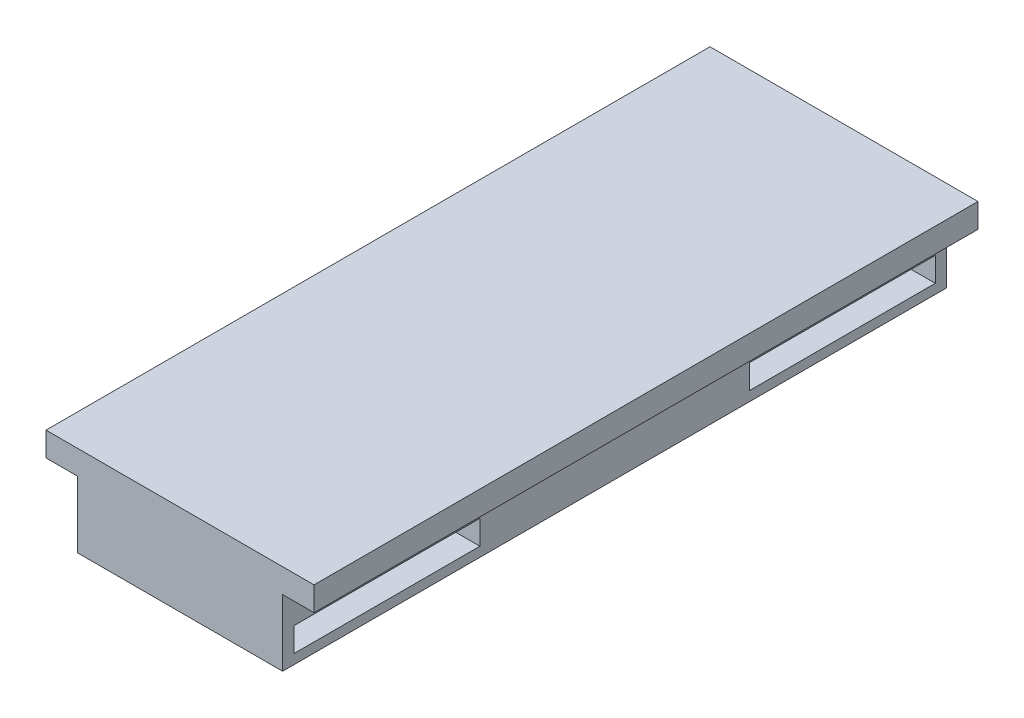
ISO-10303-21;
HEADER;
FILE_DESCRIPTION(('STEP AP214'),'2;1');
FILE_NAME('part.step','',(''),(''),'','','');
FILE_SCHEMA(('AUTOMOTIVE_DESIGN { 1 0 10303 214 1 1 1 1 }'));
ENDSEC;
DATA;
#1=APPLICATION_CONTEXT('core data for automotive mechanical design processes');
#2=APPLICATION_PROTOCOL_DEFINITION('international standard','automotive_design',2000,#1);
#3=PRODUCT_CONTEXT('',#1,'mechanical');
#4=PRODUCT('Part','Part','',(#3));
#5=PRODUCT_RELATED_PRODUCT_CATEGORY('part','',(#4));
#6=PRODUCT_DEFINITION_FORMATION('','',#4);
#7=PRODUCT_DEFINITION_CONTEXT('part definition',#1,'design');
#8=PRODUCT_DEFINITION('design','',#6,#7);
#9=PRODUCT_DEFINITION_SHAPE('','',#8);
#10=(LENGTH_UNIT() NAMED_UNIT(*) SI_UNIT(.MILLI.,.METRE.));
#11=(NAMED_UNIT(*) PLANE_ANGLE_UNIT() SI_UNIT($,.RADIAN.));
#12=(NAMED_UNIT(*) SI_UNIT($,.STERADIAN.) SOLID_ANGLE_UNIT());
#13=UNCERTAINTY_MEASURE_WITH_UNIT(LENGTH_MEASURE(1.E-05),#10,'distance_accuracy_value','');
#14=(GEOMETRIC_REPRESENTATION_CONTEXT(3) GLOBAL_UNCERTAINTY_ASSIGNED_CONTEXT((#13)) GLOBAL_UNIT_ASSIGNED_CONTEXT((#10,
#11,#12)) REPRESENTATION_CONTEXT('',''));
#15=CARTESIAN_POINT('',(0.,0.,0.));
#16=DIRECTION('',(0.,0.,1.));
#17=DIRECTION('',(1.,0.,0.));
#18=AXIS2_PLACEMENT_3D('',#15,#16,#17);
#19=CARTESIAN_POINT('',(11.1,0.519205922994457,-8.64));
#20=DIRECTION('',(0.,-1.,0.));
#21=DIRECTION('',(0.,0.,-1.));
#22=AXIS2_PLACEMENT_3D('',#19,#20,#21);
#23=CYLINDRICAL_SURFACE('',#22,7.7);
#24=DIRECTION('',(0.,-1.,0.));
#25=VECTOR('',#24,1.);
#26=CARTESIAN_POINT('',(11.1,0.519205922994459,-0.940000000000003));
#27=LINE('',#26,#25);
#28=CARTESIAN_POINT('',(11.1,0.519205922994459,-0.940000000000003));
#29=VERTEX_POINT('',#28);
#30=CARTESIAN_POINT('',(11.1,-1.48079407700554,-0.940000000000003));
#31=VERTEX_POINT('',#30);
#32=EDGE_CURVE('E150',#29,#31,#27,.T.);
#33=ORIENTED_EDGE('',*,*,#32,.T.);
#34=CARTESIAN_POINT('',(11.1,-1.48079407700554,-8.64));
#35=DIRECTION('',(0.,-1.,0.));
#36=DIRECTION('',(0.,0.,-1.));
#37=AXIS2_PLACEMENT_3D('',#34,#35,#36);
#38=CIRCLE('',#37,7.7);
#39=CARTESIAN_POINT('',(11.1,-1.48079407700554,-16.34));
#40=VERTEX_POINT('',#39);
#41=EDGE_CURVE('E44',#40,#31,#38,.F.);
#42=ORIENTED_EDGE('',*,*,#41,.F.);
#43=DIRECTION('',(0.,1.,0.));
#44=VECTOR('',#43,1.);
#45=CARTESIAN_POINT('',(11.1,0.519205922994459,-16.34));
#46=LINE('',#45,#44);
#47=CARTESIAN_POINT('',(11.1,0.519205922994457,-16.34));
#48=VERTEX_POINT('',#47);
#49=EDGE_CURVE('E157',#40,#48,#46,.T.);
#50=ORIENTED_EDGE('',*,*,#49,.T.);
#51=CARTESIAN_POINT('',(11.1,0.519205922994457,-8.64));
#52=DIRECTION('',(0.,-1.,0.));
#53=DIRECTION('',(0.,0.,-1.));
#54=AXIS2_PLACEMENT_3D('',#51,#52,#53);
#55=CIRCLE('',#54,7.7);
#56=EDGE_CURVE('E163',#29,#48,#55,.T.);
#57=ORIENTED_EDGE('',*,*,#56,.F.);
#58=EDGE_LOOP('',(#33,#42,#50,#57));
#59=FACE_BOUND('',#58,.T.);
#60=ADVANCED_FACE('F36',(#59),#23,.F.);
#61=CARTESIAN_POINT('',(11.1,0.519205922994457,-46.36));
#62=DIRECTION('',(0.,-1.,0.));
#63=DIRECTION('',(0.,0.,-1.));
#64=AXIS2_PLACEMENT_3D('',#61,#62,#63);
#65=CYLINDRICAL_SURFACE('',#64,7.7);
#66=DIRECTION('',(0.,-1.,0.));
#67=VECTOR('',#66,1.);
#68=CARTESIAN_POINT('',(11.1,0.519205922994459,-38.66));
#69=LINE('',#68,#67);
#70=CARTESIAN_POINT('',(11.1,0.519205922994459,-38.66));
#71=VERTEX_POINT('',#70);
#72=CARTESIAN_POINT('',(11.1,-1.48079407700554,-38.66));
#73=VERTEX_POINT('',#72);
#74=EDGE_CURVE('E262',#71,#73,#69,.T.);
#75=ORIENTED_EDGE('',*,*,#74,.T.);
#76=CARTESIAN_POINT('',(11.1,-1.48079407700554,-46.36));
#77=DIRECTION('',(0.,-1.,0.));
#78=DIRECTION('',(0.,0.,-1.));
#79=AXIS2_PLACEMENT_3D('',#76,#77,#78);
#80=CIRCLE('',#79,7.7);
#81=CARTESIAN_POINT('',(11.1,-1.48079407700554,-54.06));
#82=VERTEX_POINT('',#81);
#83=EDGE_CURVE('E11',#82,#73,#80,.F.);
#84=ORIENTED_EDGE('',*,*,#83,.F.);
#85=DIRECTION('',(0.,1.,0.));
#86=VECTOR('',#85,1.);
#87=CARTESIAN_POINT('',(11.1,0.519205922994459,-54.06));
#88=LINE('',#87,#86);
#89=CARTESIAN_POINT('',(11.1,0.519205922994457,-54.06));
#90=VERTEX_POINT('',#89);
#91=EDGE_CURVE('E253',#82,#90,#88,.T.);
#92=ORIENTED_EDGE('',*,*,#91,.T.);
#93=CARTESIAN_POINT('',(11.1,0.519205922994457,-46.36));
#94=DIRECTION('',(0.,-1.,0.));
#95=DIRECTION('',(0.,0.,-1.));
#96=AXIS2_PLACEMENT_3D('',#93,#94,#95);
#97=CIRCLE('',#96,7.7);
#98=EDGE_CURVE('E233',#71,#90,#97,.T.);
#99=ORIENTED_EDGE('',*,*,#98,.F.);
#100=EDGE_LOOP('',(#75,#84,#92,#99));
#101=FACE_BOUND('',#100,.T.);
#102=ADVANCED_FACE('F303',(#101),#65,.F.);
#103=CARTESIAN_POINT('',(2.6,-2.28079407700554,-55.));
#104=DIRECTION('',(-1.,0.,0.));
#105=DIRECTION('',(0.,-1.,0.));
#106=AXIS2_PLACEMENT_3D('',#103,#104,#105);
#107=PLANE('',#106);
#108=DIRECTION('',(0.,-1.,0.));
#109=VECTOR('',#108,1.);
#110=CARTESIAN_POINT('',(2.6,-2.28079407700554,0.));
#111=LINE('',#110,#109);
#112=CARTESIAN_POINT('',(2.6,3.21920592299446,0.));
#113=VERTEX_POINT('',#112);
#114=CARTESIAN_POINT('',(2.6,-2.28079407700554,0.));
#115=VERTEX_POINT('',#114);
#116=EDGE_CURVE('E208',#113,#115,#111,.T.);
#117=ORIENTED_EDGE('',*,*,#116,.F.);
#118=DIRECTION('',(0.,0.,1.));
#119=VECTOR('',#118,1.);
#120=CARTESIAN_POINT('',(2.6,3.21920592299446,-55.));
#121=LINE('',#120,#119);
#122=CARTESIAN_POINT('',(2.6,3.21920592299446,-55.));
#123=VERTEX_POINT('',#122);
#124=EDGE_CURVE('E168',#123,#113,#121,.T.);
#125=ORIENTED_EDGE('',*,*,#124,.F.);
#126=DIRECTION('',(0.,-1.,0.));
#127=VECTOR('',#126,1.);
#128=CARTESIAN_POINT('',(2.6,-2.28079407700554,-55.));
#129=LINE('',#128,#127);
#130=CARTESIAN_POINT('',(2.6,-2.28079407700554,-55.));
#131=VERTEX_POINT('',#130);
#132=EDGE_CURVE('E189',#123,#131,#129,.T.);
#133=ORIENTED_EDGE('',*,*,#132,.T.);
#134=DIRECTION('',(0.,0.,1.));
#135=VECTOR('',#134,1.);
#136=CARTESIAN_POINT('',(2.6,-2.28079407700554,-55.));
#137=LINE('',#136,#135);
#138=EDGE_CURVE('E172',#131,#115,#137,.T.);
#139=ORIENTED_EDGE('',*,*,#138,.T.);
#140=EDGE_LOOP('',(#117,#125,#133,#139));
#141=FACE_BOUND('',#140,.T.);
#142=ADVANCED_FACE('F38',(#141),#107,.T.);
#143=CARTESIAN_POINT('',(2.6,3.21920592299446,-55.));
#144=DIRECTION('',(0.,-1.,0.));
#145=DIRECTION('',(1.,0.,0.));
#146=AXIS2_PLACEMENT_3D('',#143,#144,#145);
#147=PLANE('',#146);
#148=DIRECTION('',(1.,0.,0.));
#149=VECTOR('',#148,1.);
#150=CARTESIAN_POINT('',(2.6,3.21920592299446,0.));
#151=LINE('',#150,#149);
#152=CARTESIAN_POINT('',(0.,3.21920592299446,0.));
#153=VERTEX_POINT('',#152);
#154=EDGE_CURVE('E186',#153,#113,#151,.T.);
#155=ORIENTED_EDGE('',*,*,#154,.F.);
#156=DIRECTION('',(0.,0.,1.));
#157=VECTOR('',#156,1.);
#158=CARTESIAN_POINT('',(0.,3.21920592299446,-55.));
#159=LINE('',#158,#157);
#160=CARTESIAN_POINT('',(0.,3.21920592299446,-55.));
#161=VERTEX_POINT('',#160);
#162=EDGE_CURVE('E169',#161,#153,#159,.T.);
#163=ORIENTED_EDGE('',*,*,#162,.F.);
#164=DIRECTION('',(1.,0.,0.));
#165=VECTOR('',#164,1.);
#166=CARTESIAN_POINT('',(2.6,3.21920592299446,-55.));
#167=LINE('',#166,#165);
#168=EDGE_CURVE('E175',#161,#123,#167,.T.);
#169=ORIENTED_EDGE('',*,*,#168,.T.);
#170=ORIENTED_EDGE('',*,*,#124,.T.);
#171=EDGE_LOOP('',(#155,#163,#169,#170));
#172=FACE_BOUND('',#171,.T.);
#173=ADVANCED_FACE('F328',(#172),#147,.T.);
#174=CARTESIAN_POINT('',(0.,3.21920592299446,-55.));
#175=DIRECTION('',(-1.,0.,0.));
#176=DIRECTION('',(0.,0.,1.));
#177=AXIS2_PLACEMENT_3D('',#174,#175,#176);
#178=PLANE('',#177);
#179=DIRECTION('',(0.,-1.,0.));
#180=VECTOR('',#179,1.);
#181=CARTESIAN_POINT('',(0.,3.21920592299446,0.));
#182=LINE('',#181,#180);
#183=CARTESIAN_POINT('',(0.,5.21920592299446,0.));
#184=VERTEX_POINT('',#183);
#185=EDGE_CURVE('E190',#184,#153,#182,.T.);
#186=ORIENTED_EDGE('',*,*,#185,.F.);
#187=DIRECTION('',(0.,0.,1.));
#188=VECTOR('',#187,1.);
#189=CARTESIAN_POINT('',(0.,5.21920592299446,-55.));
#190=LINE('',#189,#188);
#191=CARTESIAN_POINT('',(0.,5.21920592299446,-55.));
#192=VERTEX_POINT('',#191);
#193=EDGE_CURVE('E183',#192,#184,#190,.T.);
#194=ORIENTED_EDGE('',*,*,#193,.F.);
#195=DIRECTION('',(0.,-1.,0.));
#196=VECTOR('',#195,1.);
#197=CARTESIAN_POINT('',(0.,3.21920592299446,-55.));
#198=LINE('',#197,#196);
#199=EDGE_CURVE('E213',#192,#161,#198,.T.);
#200=ORIENTED_EDGE('',*,*,#199,.T.);
#201=ORIENTED_EDGE('',*,*,#162,.T.);
#202=EDGE_LOOP('',(#186,#194,#200,#201));
#203=FACE_BOUND('',#202,.T.);
#204=ADVANCED_FACE('F331',(#203),#178,.T.);
#205=CARTESIAN_POINT('',(0.,5.21920592299446,-55.));
#206=DIRECTION('',(0.,1.,0.));
#207=DIRECTION('',(-1.,0.,0.));
#208=AXIS2_PLACEMENT_3D('',#205,#206,#207);
#209=PLANE('',#208);
#210=DIRECTION('',(-1.,0.,0.));
#211=VECTOR('',#210,1.);
#212=CARTESIAN_POINT('',(0.,5.21920592299446,0.));
#213=LINE('',#212,#211);
#214=CARTESIAN_POINT('',(22.2,5.21920592299446,0.));
#215=VERTEX_POINT('',#214);
#216=EDGE_CURVE('E193',#215,#184,#213,.T.);
#217=ORIENTED_EDGE('',*,*,#216,.F.);
#218=DIRECTION('',(0.,0.,1.));
#219=VECTOR('',#218,1.);
#220=CARTESIAN_POINT('',(22.2,5.21920592299446,-55.));
#221=LINE('',#220,#219);
#222=CARTESIAN_POINT('',(22.2,5.21920592299446,-55.));
#223=VERTEX_POINT('',#222);
#224=EDGE_CURVE('E181',#223,#215,#221,.T.);
#225=ORIENTED_EDGE('',*,*,#224,.F.);
#226=DIRECTION('',(-1.,0.,0.));
#227=VECTOR('',#226,1.);
#228=CARTESIAN_POINT('',(0.,5.21920592299446,-55.));
#229=LINE('',#228,#227);
#230=EDGE_CURVE('E216',#223,#192,#229,.T.);
#231=ORIENTED_EDGE('',*,*,#230,.T.);
#232=ORIENTED_EDGE('',*,*,#193,.T.);
#233=EDGE_LOOP('',(#217,#225,#231,#232));
#234=FACE_BOUND('',#233,.T.);
#235=ADVANCED_FACE('F335',(#234),#209,.T.);
#236=CARTESIAN_POINT('',(22.2,5.21920592299446,-55.));
#237=DIRECTION('',(1.,0.,0.));
#238=DIRECTION('',(0.,0.,-1.));
#239=AXIS2_PLACEMENT_3D('',#236,#237,#238);
#240=PLANE('',#239);
#241=DIRECTION('',(0.,1.,0.));
#242=VECTOR('',#241,1.);
#243=CARTESIAN_POINT('',(22.2,5.21920592299446,0.));
#244=LINE('',#243,#242);
#245=CARTESIAN_POINT('',(22.2,3.21920592299446,0.));
#246=VERTEX_POINT('',#245);
#247=EDGE_CURVE('E196',#246,#215,#244,.T.);
#248=ORIENTED_EDGE('',*,*,#247,.F.);
#249=DIRECTION('',(0.,0.,1.));
#250=VECTOR('',#249,1.);
#251=CARTESIAN_POINT('',(22.2,3.21920592299446,-55.));
#252=LINE('',#251,#250);
#253=CARTESIAN_POINT('',(22.2,3.21920592299446,-55.));
#254=VERTEX_POINT('',#253);
#255=EDGE_CURVE('E179',#254,#246,#252,.T.);
#256=ORIENTED_EDGE('',*,*,#255,.F.);
#257=DIRECTION('',(0.,1.,0.));
#258=VECTOR('',#257,1.);
#259=CARTESIAN_POINT('',(22.2,5.21920592299446,-55.));
#260=LINE('',#259,#258);
#261=EDGE_CURVE('E219',#254,#223,#260,.T.);
#262=ORIENTED_EDGE('',*,*,#261,.T.);
#263=ORIENTED_EDGE('',*,*,#224,.T.);
#264=EDGE_LOOP('',(#248,#256,#262,#263));
#265=FACE_BOUND('',#264,.T.);
#266=ADVANCED_FACE('F339',(#265),#240,.T.);
#267=CARTESIAN_POINT('',(22.2,3.21920592299446,-55.));
#268=DIRECTION('',(0.,-1.,0.));
#269=DIRECTION('',(1.,0.,0.));
#270=AXIS2_PLACEMENT_3D('',#267,#268,#269);
#271=PLANE('',#270);
#272=DIRECTION('',(1.,0.,0.));
#273=VECTOR('',#272,1.);
#274=CARTESIAN_POINT('',(22.2,3.21920592299446,0.));
#275=LINE('',#274,#273);
#276=CARTESIAN_POINT('',(19.6,3.21920592299446,0.));
#277=VERTEX_POINT('',#276);
#278=EDGE_CURVE('E199',#277,#246,#275,.T.);
#279=ORIENTED_EDGE('',*,*,#278,.F.);
#280=DIRECTION('',(0.,0.,1.));
#281=VECTOR('',#280,1.);
#282=CARTESIAN_POINT('',(19.6,3.21920592299446,-55.));
#283=LINE('',#282,#281);
#284=CARTESIAN_POINT('',(19.6,3.21920592299446,-55.));
#285=VERTEX_POINT('',#284);
#286=EDGE_CURVE('E177',#285,#277,#283,.T.);
#287=ORIENTED_EDGE('',*,*,#286,.F.);
#288=DIRECTION('',(1.,0.,0.));
#289=VECTOR('',#288,1.);
#290=CARTESIAN_POINT('',(22.2,3.21920592299446,-55.));
#291=LINE('',#290,#289);
#292=EDGE_CURVE('E222',#285,#254,#291,.T.);
#293=ORIENTED_EDGE('',*,*,#292,.T.);
#294=ORIENTED_EDGE('',*,*,#255,.T.);
#295=EDGE_LOOP('',(#279,#287,#293,#294));
#296=FACE_BOUND('',#295,.T.);
#297=ADVANCED_FACE('F343',(#296),#271,.T.);
#298=CARTESIAN_POINT('',(19.6,-2.28079407700554,-55.));
#299=DIRECTION('',(1.,0.,0.));
#300=DIRECTION('',(0.,0.,-1.));
#301=AXIS2_PLACEMENT_3D('',#298,#299,#300);
#302=PLANE('',#301);
#303=DIRECTION('',(0.,-1.,0.));
#304=VECTOR('',#303,1.);
#305=CARTESIAN_POINT('',(19.6,0.519205922994459,-0.940000000000003));
#306=LINE('',#305,#304);
#307=CARTESIAN_POINT('',(19.6,0.519205922994459,-0.940000000000003));
#308=VERTEX_POINT('',#307);
#309=CARTESIAN_POINT('',(19.6,-1.48079407700554,-0.940000000000003));
#310=VERTEX_POINT('',#309);
#311=EDGE_CURVE('E51',#308,#310,#306,.T.);
#312=ORIENTED_EDGE('',*,*,#311,.F.);
#313=DIRECTION('',(0.,0.,1.));
#314=VECTOR('',#313,1.);
#315=CARTESIAN_POINT('',(19.6,0.519205922994459,-0.940000000000003));
#316=LINE('',#315,#314);
#317=CARTESIAN_POINT('',(19.6,0.519205922994459,-16.34));
#318=VERTEX_POINT('',#317);
#319=EDGE_CURVE('E164',#318,#308,#316,.T.);
#320=ORIENTED_EDGE('',*,*,#319,.F.);
#321=DIRECTION('',(0.,1.,0.));
#322=VECTOR('',#321,1.);
#323=CARTESIAN_POINT('',(19.6,0.519205922994459,-16.34));
#324=LINE('',#323,#322);
#325=CARTESIAN_POINT('',(19.6,-1.48079407700554,-16.34));
#326=VERTEX_POINT('',#325);
#327=EDGE_CURVE('E280',#326,#318,#324,.T.);
#328=ORIENTED_EDGE('',*,*,#327,.F.);
#329=DIRECTION('',(0.,0.,-1.));
#330=VECTOR('',#329,1.);
#331=CARTESIAN_POINT('',(19.6,-1.48079407700554,-0.940000000000003));
#332=LINE('',#331,#330);
#333=EDGE_CURVE('E283',#310,#326,#332,.T.);
#334=ORIENTED_EDGE('',*,*,#333,.F.);
#335=EDGE_LOOP('',(#312,#320,#328,#334));
#336=FACE_BOUND('',#335,.T.);
#337=DIRECTION('',(0.,-1.,0.));
#338=VECTOR('',#337,1.);
#339=CARTESIAN_POINT('',(19.6,0.519205922994459,-38.66));
#340=LINE('',#339,#338);
#341=CARTESIAN_POINT('',(19.6,0.519205922994459,-38.66));
#342=VERTEX_POINT('',#341);
#343=CARTESIAN_POINT('',(19.6,-1.48079407700554,-38.66));
#344=VERTEX_POINT('',#343);
#345=EDGE_CURVE('E59',#342,#344,#340,.T.);
#346=ORIENTED_EDGE('',*,*,#345,.F.);
#347=DIRECTION('',(0.,0.,1.));
#348=VECTOR('',#347,1.);
#349=CARTESIAN_POINT('',(19.6,0.519205922994459,-38.66));
#350=LINE('',#349,#348);
#351=CARTESIAN_POINT('',(19.6,0.519205922994459,-54.06));
#352=VERTEX_POINT('',#351);
#353=EDGE_CURVE('E259',#352,#342,#350,.T.);
#354=ORIENTED_EDGE('',*,*,#353,.F.);
#355=DIRECTION('',(0.,1.,0.));
#356=VECTOR('',#355,1.);
#357=CARTESIAN_POINT('',(19.6,0.519205922994459,-54.06));
#358=LINE('',#357,#356);
#359=CARTESIAN_POINT('',(19.6,-1.48079407700554,-54.06));
#360=VERTEX_POINT('',#359);
#361=EDGE_CURVE('E263',#360,#352,#358,.T.);
#362=ORIENTED_EDGE('',*,*,#361,.F.);
#363=DIRECTION('',(0.,0.,-1.));
#364=VECTOR('',#363,1.);
#365=CARTESIAN_POINT('',(19.6,-1.48079407700554,-38.66));
#366=LINE('',#365,#364);
#367=EDGE_CURVE('E266',#344,#360,#366,.T.);
#368=ORIENTED_EDGE('',*,*,#367,.F.);
#369=EDGE_LOOP('',(#346,#354,#362,#368));
#370=FACE_BOUND('',#369,.T.);
#371=DIRECTION('',(0.,1.,0.));
#372=VECTOR('',#371,1.);
#373=CARTESIAN_POINT('',(19.6,-2.28079407700554,0.));
#374=LINE('',#373,#372);
#375=CARTESIAN_POINT('',(19.6,-2.28079407700554,0.));
#376=VERTEX_POINT('',#375);
#377=EDGE_CURVE('E202',#376,#277,#374,.T.);
#378=ORIENTED_EDGE('',*,*,#377,.F.);
#379=DIRECTION('',(0.,0.,1.));
#380=VECTOR('',#379,1.);
#381=CARTESIAN_POINT('',(19.6,-2.28079407700554,-55.));
#382=LINE('',#381,#380);
#383=CARTESIAN_POINT('',(19.6,-2.28079407700554,-55.));
#384=VERTEX_POINT('',#383);
#385=EDGE_CURVE('E174',#384,#376,#382,.T.);
#386=ORIENTED_EDGE('',*,*,#385,.F.);
#387=DIRECTION('',(0.,1.,0.));
#388=VECTOR('',#387,1.);
#389=CARTESIAN_POINT('',(19.6,-2.28079407700554,-55.));
#390=LINE('',#389,#388);
#391=EDGE_CURVE('E225',#384,#285,#390,.T.);
#392=ORIENTED_EDGE('',*,*,#391,.T.);
#393=ORIENTED_EDGE('',*,*,#286,.T.);
#394=EDGE_LOOP('',(#378,#386,#392,#393));
#395=FACE_BOUND('',#394,.T.);
#396=ADVANCED_FACE('F292',(#336,#370,#395),#302,.T.);
#397=CARTESIAN_POINT('',(2.6,-2.28079407700554,-55.));
#398=DIRECTION('',(0.,-1.,0.));
#399=DIRECTION('',(1.,0.,0.));
#400=AXIS2_PLACEMENT_3D('',#397,#398,#399);
#401=PLANE('',#400);
#402=DIRECTION('',(1.,0.,0.));
#403=VECTOR('',#402,1.);
#404=CARTESIAN_POINT('',(2.6,-2.28079407700554,0.));
#405=LINE('',#404,#403);
#406=EDGE_CURVE('E205',#115,#376,#405,.T.);
#407=ORIENTED_EDGE('',*,*,#406,.F.);
#408=ORIENTED_EDGE('',*,*,#138,.F.);
#409=DIRECTION('',(1.,0.,0.));
#410=VECTOR('',#409,1.);
#411=CARTESIAN_POINT('',(2.6,-2.28079407700554,-55.));
#412=LINE('',#411,#410);
#413=EDGE_CURVE('E228',#131,#384,#412,.T.);
#414=ORIENTED_EDGE('',*,*,#413,.T.);
#415=ORIENTED_EDGE('',*,*,#385,.T.);
#416=EDGE_LOOP('',(#407,#408,#414,#415));
#417=FACE_BOUND('',#416,.T.);
#418=CARTESIAN_POINT('',(11.1,-2.28079407700554,-8.64));
#419=DIRECTION('',(0.,-1.,0.));
#420=DIRECTION('',(0.,0.,-1.));
#421=AXIS2_PLACEMENT_3D('',#418,#419,#420);
#422=CIRCLE('',#421,5.5);
#423=CARTESIAN_POINT('',(11.1,-2.28079407700554,-14.14));
#424=VERTEX_POINT('',#423);
#425=EDGE_CURVE('E238',#424,#424,#422,.T.);
#426=ORIENTED_EDGE('',*,*,#425,.F.);
#427=EDGE_LOOP('',(#426));
#428=FACE_BOUND('',#427,.T.);
#429=CARTESIAN_POINT('',(11.1,-2.28079407700554,-46.36));
#430=DIRECTION('',(0.,-1.,0.));
#431=DIRECTION('',(0.,0.,-1.));
#432=AXIS2_PLACEMENT_3D('',#429,#430,#431);
#433=CIRCLE('',#432,5.5);
#434=CARTESIAN_POINT('',(11.1,-2.28079407700554,-51.86));
#435=VERTEX_POINT('',#434);
#436=EDGE_CURVE('E244',#435,#435,#433,.T.);
#437=ORIENTED_EDGE('',*,*,#436,.F.);
#438=EDGE_LOOP('',(#437));
#439=FACE_BOUND('',#438,.T.);
#440=ADVANCED_FACE('F323',(#417,#428,#439),#401,.T.);
#441=CARTESIAN_POINT('',(0.,0.,-55.));
#442=DIRECTION('',(0.,0.,1.));
#443=DIRECTION('',(1.,0.,0.));
#444=AXIS2_PLACEMENT_3D('',#441,#442,#443);
#445=PLANE('',#444);
#446=ORIENTED_EDGE('',*,*,#132,.F.);
#447=ORIENTED_EDGE('',*,*,#168,.F.);
#448=ORIENTED_EDGE('',*,*,#199,.F.);
#449=ORIENTED_EDGE('',*,*,#230,.F.);
#450=ORIENTED_EDGE('',*,*,#261,.F.);
#451=ORIENTED_EDGE('',*,*,#292,.F.);
#452=ORIENTED_EDGE('',*,*,#391,.F.);
#453=ORIENTED_EDGE('',*,*,#413,.F.);
#454=EDGE_LOOP('',(#446,#447,#448,#449,#450,#451,#452,#453));
#455=FACE_BOUND('',#454,.T.);
#456=ADVANCED_FACE('F319',(#455),#445,.F.);
#457=CARTESIAN_POINT('',(0.,0.,0.));
#458=DIRECTION('',(0.,0.,1.));
#459=DIRECTION('',(1.,0.,0.));
#460=AXIS2_PLACEMENT_3D('',#457,#458,#459);
#461=PLANE('',#460);
#462=ORIENTED_EDGE('',*,*,#116,.T.);
#463=ORIENTED_EDGE('',*,*,#406,.T.);
#464=ORIENTED_EDGE('',*,*,#377,.T.);
#465=ORIENTED_EDGE('',*,*,#278,.T.);
#466=ORIENTED_EDGE('',*,*,#247,.T.);
#467=ORIENTED_EDGE('',*,*,#216,.T.);
#468=ORIENTED_EDGE('',*,*,#185,.T.);
#469=ORIENTED_EDGE('',*,*,#154,.T.);
#470=EDGE_LOOP('',(#462,#463,#464,#465,#466,#467,#468,#469));
#471=FACE_BOUND('',#470,.T.);
#472=ADVANCED_FACE('F322',(#471),#461,.T.);
#473=CARTESIAN_POINT('',(11.1,-1.48079407700554,-8.64));
#474=DIRECTION('',(0.,-1.,0.));
#475=DIRECTION('',(0.,0.,-1.));
#476=AXIS2_PLACEMENT_3D('',#473,#474,#475);
#477=PLANE('',#476);
#478=CARTESIAN_POINT('',(11.1,-1.48079407700554,-8.64));
#479=DIRECTION('',(0.,-1.,0.));
#480=DIRECTION('',(0.,0.,-1.));
#481=AXIS2_PLACEMENT_3D('',#478,#479,#480);
#482=CIRCLE('',#481,5.5);
#483=CARTESIAN_POINT('',(11.1,-1.48079407700554,-14.14));
#484=VERTEX_POINT('',#483);
#485=EDGE_CURVE('E236',#484,#484,#482,.T.);
#486=ORIENTED_EDGE('',*,*,#485,.T.);
#487=EDGE_LOOP('',(#486));
#488=FACE_BOUND('',#487,.T.);
#489=DIRECTION('',(1.,0.,0.));
#490=VECTOR('',#489,1.);
#491=CARTESIAN_POINT('',(11.1,-1.48079407700554,-16.34));
#492=LINE('',#491,#490);
#493=EDGE_CURVE('E156',#40,#326,#492,.T.);
#494=ORIENTED_EDGE('',*,*,#493,.F.);
#495=ORIENTED_EDGE('',*,*,#41,.T.);
#496=DIRECTION('',(1.,0.,0.));
#497=VECTOR('',#496,1.);
#498=CARTESIAN_POINT('',(11.1,-1.48079407700554,-0.940000000000003));
#499=LINE('',#498,#497);
#500=EDGE_CURVE('E147',#31,#310,#499,.T.);
#501=ORIENTED_EDGE('',*,*,#500,.T.);
#502=ORIENTED_EDGE('',*,*,#333,.T.);
#503=EDGE_LOOP('',(#494,#495,#501,#502));
#504=FACE_BOUND('',#503,.T.);
#505=ADVANCED_FACE('F166',(#488,#504),#477,.F.);
#506=CARTESIAN_POINT('',(11.1,-1.48079407700554,-8.64));
#507=DIRECTION('',(0.,-1.,0.));
#508=DIRECTION('',(0.,0.,-1.));
#509=AXIS2_PLACEMENT_3D('',#506,#507,#508);
#510=CYLINDRICAL_SURFACE('',#509,5.5);
#511=ORIENTED_EDGE('',*,*,#485,.F.);
#512=EDGE_LOOP('',(#511));
#513=FACE_BOUND('',#512,.T.);
#514=ORIENTED_EDGE('',*,*,#425,.T.);
#515=EDGE_LOOP('',(#514));
#516=FACE_BOUND('',#515,.T.);
#517=ADVANCED_FACE('F372',(#513,#516),#510,.F.);
#518=CARTESIAN_POINT('',(11.1,0.519205922994457,-8.64));
#519=DIRECTION('',(0.,-1.,0.));
#520=DIRECTION('',(0.,0.,-1.));
#521=AXIS2_PLACEMENT_3D('',#518,#519,#520);
#522=PLANE('',#521);
#523=DIRECTION('',(1.,0.,0.));
#524=VECTOR('',#523,1.);
#525=CARTESIAN_POINT('',(11.1,0.519205922994459,-0.940000000000003));
#526=LINE('',#525,#524);
#527=EDGE_CURVE('E247',#29,#308,#526,.T.);
#528=ORIENTED_EDGE('',*,*,#527,.F.);
#529=ORIENTED_EDGE('',*,*,#56,.T.);
#530=DIRECTION('',(1.,0.,0.));
#531=VECTOR('',#530,1.);
#532=CARTESIAN_POINT('',(11.1,0.519205922994459,-16.34));
#533=LINE('',#532,#531);
#534=EDGE_CURVE('E275',#48,#318,#533,.T.);
#535=ORIENTED_EDGE('',*,*,#534,.T.);
#536=ORIENTED_EDGE('',*,*,#319,.T.);
#537=EDGE_LOOP('',(#528,#529,#535,#536));
#538=FACE_BOUND('',#537,.T.);
#539=ADVANCED_FACE('F288',(#538),#522,.T.);
#540=CARTESIAN_POINT('',(11.1,-1.48079407700554,-46.36));
#541=DIRECTION('',(0.,-1.,0.));
#542=DIRECTION('',(0.,0.,-1.));
#543=AXIS2_PLACEMENT_3D('',#540,#541,#542);
#544=PLANE('',#543);
#545=CARTESIAN_POINT('',(11.1,-1.48079407700554,-46.36));
#546=DIRECTION('',(0.,-1.,0.));
#547=DIRECTION('',(0.,0.,-1.));
#548=AXIS2_PLACEMENT_3D('',#545,#546,#547);
#549=CIRCLE('',#548,5.5);
#550=CARTESIAN_POINT('',(11.1,-1.48079407700554,-51.86));
#551=VERTEX_POINT('',#550);
#552=EDGE_CURVE('E241',#551,#551,#549,.T.);
#553=ORIENTED_EDGE('',*,*,#552,.T.);
#554=EDGE_LOOP('',(#553));
#555=FACE_BOUND('',#554,.T.);
#556=DIRECTION('',(1.,0.,0.));
#557=VECTOR('',#556,1.);
#558=CARTESIAN_POINT('',(11.1,-1.48079407700554,-54.06));
#559=LINE('',#558,#557);
#560=EDGE_CURVE('E252',#82,#360,#559,.T.);
#561=ORIENTED_EDGE('',*,*,#560,.F.);
#562=ORIENTED_EDGE('',*,*,#83,.T.);
#563=DIRECTION('',(1.,0.,0.));
#564=VECTOR('',#563,1.);
#565=CARTESIAN_POINT('',(11.1,-1.48079407700554,-38.66));
#566=LINE('',#565,#564);
#567=EDGE_CURVE('E250',#73,#344,#566,.T.);
#568=ORIENTED_EDGE('',*,*,#567,.T.);
#569=ORIENTED_EDGE('',*,*,#367,.T.);
#570=EDGE_LOOP('',(#561,#562,#568,#569));
#571=FACE_BOUND('',#570,.T.);
#572=ADVANCED_FACE('F360',(#555,#571),#544,.F.);
#573=CARTESIAN_POINT('',(11.1,-1.48079407700554,-46.36));
#574=DIRECTION('',(0.,-1.,0.));
#575=DIRECTION('',(0.,0.,-1.));
#576=AXIS2_PLACEMENT_3D('',#573,#574,#575);
#577=CYLINDRICAL_SURFACE('',#576,5.5);
#578=ORIENTED_EDGE('',*,*,#552,.F.);
#579=EDGE_LOOP('',(#578));
#580=FACE_BOUND('',#579,.T.);
#581=ORIENTED_EDGE('',*,*,#436,.T.);
#582=EDGE_LOOP('',(#581));
#583=FACE_BOUND('',#582,.T.);
#584=ADVANCED_FACE('F316',(#580,#583),#577,.F.);
#585=CARTESIAN_POINT('',(11.1,0.519205922994457,-46.36));
#586=DIRECTION('',(0.,-1.,0.));
#587=DIRECTION('',(0.,0.,-1.));
#588=AXIS2_PLACEMENT_3D('',#585,#586,#587);
#589=PLANE('',#588);
#590=DIRECTION('',(1.,0.,0.));
#591=VECTOR('',#590,1.);
#592=CARTESIAN_POINT('',(11.1,0.519205922994459,-38.66));
#593=LINE('',#592,#591);
#594=EDGE_CURVE('E257',#71,#342,#593,.T.);
#595=ORIENTED_EDGE('',*,*,#594,.F.);
#596=ORIENTED_EDGE('',*,*,#98,.T.);
#597=DIRECTION('',(1.,0.,0.));
#598=VECTOR('',#597,1.);
#599=CARTESIAN_POINT('',(11.1,0.519205922994459,-54.06));
#600=LINE('',#599,#598);
#601=EDGE_CURVE('E255',#90,#352,#600,.T.);
#602=ORIENTED_EDGE('',*,*,#601,.T.);
#603=ORIENTED_EDGE('',*,*,#353,.T.);
#604=EDGE_LOOP('',(#595,#596,#602,#603));
#605=FACE_BOUND('',#604,.T.);
#606=ADVANCED_FACE('F313',(#605),#589,.T.);
#607=CARTESIAN_POINT('',(11.1,0.519205922994459,-38.66));
#608=DIRECTION('',(0.,0.,1.));
#609=DIRECTION('',(1.,0.,0.));
#610=AXIS2_PLACEMENT_3D('',#607,#608,#609);
#611=PLANE('',#610);
#612=ORIENTED_EDGE('',*,*,#345,.T.);
#613=ORIENTED_EDGE('',*,*,#567,.F.);
#614=ORIENTED_EDGE('',*,*,#74,.F.);
#615=ORIENTED_EDGE('',*,*,#594,.T.);
#616=EDGE_LOOP('',(#612,#613,#614,#615));
#617=FACE_BOUND('',#616,.T.);
#618=ADVANCED_FACE('F315',(#617),#611,.F.);
#619=CARTESIAN_POINT('',(11.1,0.519205922994459,-54.06));
#620=DIRECTION('',(0.,0.,-1.));
#621=DIRECTION('',(-1.,0.,0.));
#622=AXIS2_PLACEMENT_3D('',#619,#620,#621);
#623=PLANE('',#622);
#624=ORIENTED_EDGE('',*,*,#361,.T.);
#625=ORIENTED_EDGE('',*,*,#601,.F.);
#626=ORIENTED_EDGE('',*,*,#91,.F.);
#627=ORIENTED_EDGE('',*,*,#560,.T.);
#628=EDGE_LOOP('',(#624,#625,#626,#627));
#629=FACE_BOUND('',#628,.T.);
#630=ADVANCED_FACE('F300',(#629),#623,.F.);
#631=CARTESIAN_POINT('',(11.1,0.519205922994459,-0.940000000000003));
#632=DIRECTION('',(0.,0.,1.));
#633=DIRECTION('',(0.,-1.,0.));
#634=AXIS2_PLACEMENT_3D('',#631,#632,#633);
#635=PLANE('',#634);
#636=ORIENTED_EDGE('',*,*,#311,.T.);
#637=ORIENTED_EDGE('',*,*,#500,.F.);
#638=ORIENTED_EDGE('',*,*,#32,.F.);
#639=ORIENTED_EDGE('',*,*,#527,.T.);
#640=EDGE_LOOP('',(#636,#637,#638,#639));
#641=FACE_BOUND('',#640,.T.);
#642=ADVANCED_FACE('F149',(#641),#635,.F.);
#643=CARTESIAN_POINT('',(11.1,0.519205922994459,-16.34));
#644=DIRECTION('',(0.,0.,-1.));
#645=DIRECTION('',(-1.,0.,0.));
#646=AXIS2_PLACEMENT_3D('',#643,#644,#645);
#647=PLANE('',#646);
#648=ORIENTED_EDGE('',*,*,#327,.T.);
#649=ORIENTED_EDGE('',*,*,#534,.F.);
#650=ORIENTED_EDGE('',*,*,#49,.F.);
#651=ORIENTED_EDGE('',*,*,#493,.T.);
#652=EDGE_LOOP('',(#648,#649,#650,#651));
#653=FACE_BOUND('',#652,.T.);
#654=ADVANCED_FACE('F294',(#653),#647,.F.);
#655=CLOSED_SHELL('',(#60,#102,#142,#173,#204,#235,#266,#297,#396,#440,#456,#472,#505,#517,#539,
#572,#584,#606,#618,#630,#642,#654));
#656=MANIFOLD_SOLID_BREP('B2',#655);
#657=ADVANCED_BREP_SHAPE_REPRESENTATION('',(#18,#656),#14);
#658=SHAPE_DEFINITION_REPRESENTATION(#9,#657);
ENDSEC;
END-ISO-10303-21;
